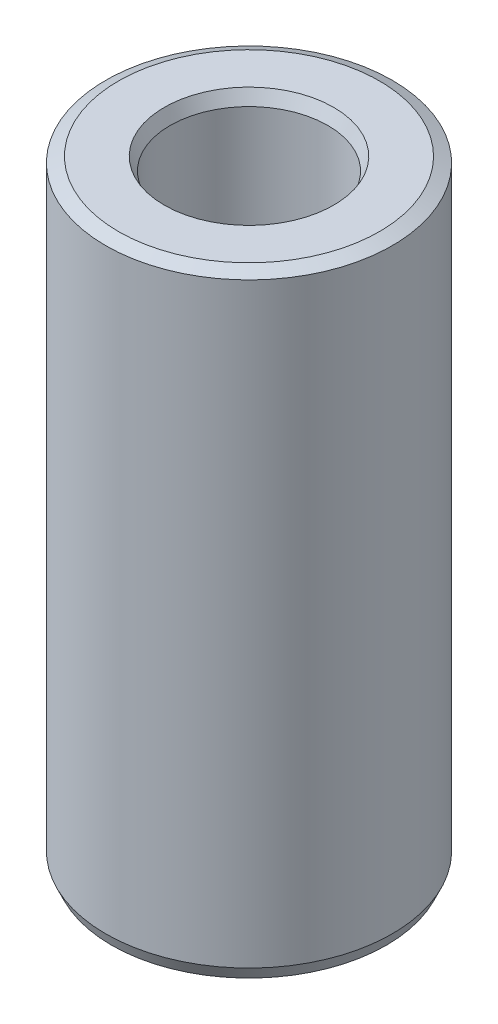
ISO-10303-21;
HEADER;
FILE_DESCRIPTION(('STEP AP214'),'2;1');
FILE_NAME('part.step','',(''),(''),'','','');
FILE_SCHEMA(('AUTOMOTIVE_DESIGN { 1 0 10303 214 1 1 1 1 }'));
ENDSEC;
DATA;
#1=APPLICATION_CONTEXT('core data for automotive mechanical design processes');
#2=APPLICATION_PROTOCOL_DEFINITION('international standard','automotive_design',2000,#1);
#3=PRODUCT_CONTEXT('',#1,'mechanical');
#4=PRODUCT('Part','Part','',(#3));
#5=PRODUCT_RELATED_PRODUCT_CATEGORY('part','',(#4));
#6=PRODUCT_DEFINITION_FORMATION('','',#4);
#7=PRODUCT_DEFINITION_CONTEXT('part definition',#1,'design');
#8=PRODUCT_DEFINITION('design','',#6,#7);
#9=PRODUCT_DEFINITION_SHAPE('','',#8);
#10=(LENGTH_UNIT() NAMED_UNIT(*) SI_UNIT(.MILLI.,.METRE.));
#11=(NAMED_UNIT(*) PLANE_ANGLE_UNIT() SI_UNIT($,.RADIAN.));
#12=(NAMED_UNIT(*) SI_UNIT($,.STERADIAN.) SOLID_ANGLE_UNIT());
#13=UNCERTAINTY_MEASURE_WITH_UNIT(LENGTH_MEASURE(1.E-05),#10,'distance_accuracy_value','');
#14=(GEOMETRIC_REPRESENTATION_CONTEXT(3) GLOBAL_UNCERTAINTY_ASSIGNED_CONTEXT((#13)) GLOBAL_UNIT_ASSIGNED_CONTEXT((#10,
#11,#12)) REPRESENTATION_CONTEXT('',''));
#15=CARTESIAN_POINT('',(0.,0.,0.));
#16=DIRECTION('',(0.,0.,1.));
#17=DIRECTION('',(1.,0.,0.));
#18=AXIS2_PLACEMENT_3D('',#15,#16,#17);
#19=CARTESIAN_POINT('',(0.,139.398685956826,0.));
#20=DIRECTION('',(0.,-1.,0.));
#21=DIRECTION('',(0.,0.,-1.));
#22=AXIS2_PLACEMENT_3D('',#19,#20,#21);
#23=CYLINDRICAL_SURFACE('',#22,32.5);
#24=CARTESIAN_POINT('',(0.,2.89853970592807,0.));
#25=DIRECTION('',(0.,1.,0.));
#26=DIRECTION('',(0.,0.,1.));
#27=AXIS2_PLACEMENT_3D('',#24,#25,#26);
#28=CIRCLE('',#27,32.5);
#29=CARTESIAN_POINT('',(0.,2.89853970592807,32.5));
#30=VERTEX_POINT('',#29);
#31=EDGE_CURVE('E10',#30,#30,#28,.T.);
#32=ORIENTED_EDGE('',*,*,#31,.T.);
#33=EDGE_LOOP('',(#32));
#34=FACE_BOUND('',#33,.T.);
#35=CARTESIAN_POINT('',(0.,138.082120174038,0.));
#36=DIRECTION('',(0.,1.,0.));
#37=DIRECTION('',(0.,0.,1.));
#38=AXIS2_PLACEMENT_3D('',#35,#36,#37);
#39=CIRCLE('',#38,32.5);
#40=CARTESIAN_POINT('',(0.,138.082120174038,32.5));
#41=VERTEX_POINT('',#40);
#42=EDGE_CURVE('E50',#41,#41,#39,.F.);
#43=ORIENTED_EDGE('',*,*,#42,.T.);
#44=EDGE_LOOP('',(#43));
#45=FACE_BOUND('',#44,.T.);
#46=ADVANCED_FACE('F39',(#34,#45),#23,.T.);
#47=CARTESIAN_POINT('',(0.,139.398685956826,0.));
#48=DIRECTION('',(0.,1.,0.));
#49=DIRECTION('',(0.,0.,1.));
#50=AXIS2_PLACEMENT_3D('',#47,#48,#49);
#51=PLANE('',#50);
#52=CARTESIAN_POINT('',(0.,139.398685956826,0.));
#53=DIRECTION('',(0.,1.,0.));
#54=DIRECTION('',(0.,0.,1.));
#55=AXIS2_PLACEMENT_3D('',#52,#53,#54);
#56=CIRCLE('',#55,19.2189035642523);
#57=CARTESIAN_POINT('',(0.,139.398685956826,19.2189035642523));
#58=VERTEX_POINT('',#57);
#59=EDGE_CURVE('E58',#58,#58,#56,.F.);
#60=ORIENTED_EDGE('',*,*,#59,.T.);
#61=EDGE_LOOP('',(#60));
#62=FACE_BOUND('',#61,.T.);
#63=CARTESIAN_POINT('',(0.,139.398685956826,0.));
#64=DIRECTION('',(0.,1.,0.));
#65=DIRECTION('',(0.,0.,1.));
#66=AXIS2_PLACEMENT_3D('',#63,#64,#65);
#67=CIRCLE('',#66,29.6014602940719);
#68=CARTESIAN_POINT('',(0.,139.398685956826,29.6014602940719));
#69=VERTEX_POINT('',#68);
#70=EDGE_CURVE('E61',#69,#69,#67,.T.);
#71=ORIENTED_EDGE('',*,*,#70,.T.);
#72=EDGE_LOOP('',(#71));
#73=FACE_BOUND('',#72,.T.);
#74=ADVANCED_FACE('F88',(#62,#73),#51,.T.);
#75=CARTESIAN_POINT('',(0.,0.,0.));
#76=DIRECTION('',(0.,1.,0.));
#77=DIRECTION('',(0.,0.,1.));
#78=AXIS2_PLACEMENT_3D('',#75,#76,#77);
#79=PLANE('',#78);
#80=CARTESIAN_POINT('',(0.,0.,0.));
#81=DIRECTION('',(0.,1.,0.));
#82=DIRECTION('',(0.,0.,1.));
#83=AXIS2_PLACEMENT_3D('',#80,#81,#82);
#84=CIRCLE('',#83,20.8008774873924);
#85=CARTESIAN_POINT('',(0.,0.,20.8008774873924));
#86=VERTEX_POINT('',#85);
#87=EDGE_CURVE('E51',#86,#86,#84,.T.);
#88=ORIENTED_EDGE('',*,*,#87,.T.);
#89=EDGE_LOOP('',(#88));
#90=FACE_BOUND('',#89,.T.);
#91=CARTESIAN_POINT('',(0.,0.,0.));
#92=DIRECTION('',(0.,1.,0.));
#93=DIRECTION('',(0.,0.,1.));
#94=AXIS2_PLACEMENT_3D('',#91,#92,#93);
#95=CIRCLE('',#94,31.183434217212);
#96=CARTESIAN_POINT('',(0.,0.,31.183434217212));
#97=VERTEX_POINT('',#96);
#98=EDGE_CURVE('E54',#97,#97,#95,.F.);
#99=ORIENTED_EDGE('',*,*,#98,.T.);
#100=EDGE_LOOP('',(#99));
#101=FACE_BOUND('',#100,.T.);
#102=ADVANCED_FACE('F83',(#90,#101),#79,.F.);
#103=CARTESIAN_POINT('',(0.,139.398685956826,0.));
#104=DIRECTION('',(0.,-1.,0.));
#105=DIRECTION('',(0.,0.,-1.));
#106=AXIS2_PLACEMENT_3D('',#103,#104,#105);
#107=CYLINDRICAL_SURFACE('',#106,17.9023377814643);
#108=CARTESIAN_POINT('',(0.,136.500146250898,0.));
#109=DIRECTION('',(0.,1.,0.));
#110=DIRECTION('',(0.,0.,1.));
#111=AXIS2_PLACEMENT_3D('',#108,#109,#110);
#112=CIRCLE('',#111,17.9023377814643);
#113=CARTESIAN_POINT('',(0.,136.500146250898,17.9023377814643));
#114=VERTEX_POINT('',#113);
#115=EDGE_CURVE('E67',#114,#114,#112,.T.);
#116=ORIENTED_EDGE('',*,*,#115,.T.);
#117=EDGE_LOOP('',(#116));
#118=FACE_BOUND('',#117,.T.);
#119=CARTESIAN_POINT('',(0.,1.31656578278802,0.));
#120=DIRECTION('',(0.,1.,0.));
#121=DIRECTION('',(0.,0.,1.));
#122=AXIS2_PLACEMENT_3D('',#119,#120,#121);
#123=CIRCLE('',#122,17.9023377814643);
#124=CARTESIAN_POINT('',(0.,1.31656578278802,17.9023377814643));
#125=VERTEX_POINT('',#124);
#126=EDGE_CURVE('E69',#125,#125,#123,.F.);
#127=ORIENTED_EDGE('',*,*,#126,.T.);
#128=EDGE_LOOP('',(#127));
#129=FACE_BOUND('',#128,.T.);
#130=ADVANCED_FACE('F71',(#118,#129),#107,.F.);
#131=CARTESIAN_POINT('',(0.,136.500146250898,0.));
#132=DIRECTION('',(0.,1.,0.));
#133=DIRECTION('',(0.,0.,1.));
#134=AXIS2_PLACEMENT_3D('',#131,#132,#133);
#135=CONICAL_SURFACE('',#134,17.9023377814643,0.426355182249462);
#136=ORIENTED_EDGE('',*,*,#59,.F.);
#137=EDGE_LOOP('',(#136));
#138=FACE_BOUND('',#137,.T.);
#139=ORIENTED_EDGE('',*,*,#115,.F.);
#140=EDGE_LOOP('',(#139));
#141=FACE_BOUND('',#140,.T.);
#142=ADVANCED_FACE('F77',(#138,#141),#135,.F.);
#143=CARTESIAN_POINT('',(0.,0.,0.));
#144=DIRECTION('',(0.,-1.,0.));
#145=DIRECTION('',(0.,0.,-1.));
#146=AXIS2_PLACEMENT_3D('',#143,#144,#145);
#147=CONICAL_SURFACE('',#146,20.8008774873924,1.14444114454543);
#148=ORIENTED_EDGE('',*,*,#126,.F.);
#149=EDGE_LOOP('',(#148));
#150=FACE_BOUND('',#149,.T.);
#151=ORIENTED_EDGE('',*,*,#87,.F.);
#152=EDGE_LOOP('',(#151));
#153=FACE_BOUND('',#152,.T.);
#154=ADVANCED_FACE('F73',(#150,#153),#147,.F.);
#155=CARTESIAN_POINT('',(0.,2.89853970592807,0.));
#156=DIRECTION('',(0.,1.,0.));
#157=DIRECTION('',(0.,0.,1.));
#158=AXIS2_PLACEMENT_3D('',#155,#156,#157);
#159=CONICAL_SURFACE('',#158,32.5,0.426355182249466);
#160=ORIENTED_EDGE('',*,*,#98,.F.);
#161=EDGE_LOOP('',(#160));
#162=FACE_BOUND('',#161,.T.);
#163=ORIENTED_EDGE('',*,*,#31,.F.);
#164=EDGE_LOOP('',(#163));
#165=FACE_BOUND('',#164,.T.);
#166=ADVANCED_FACE('F76',(#162,#165),#159,.T.);
#167=CARTESIAN_POINT('',(0.,139.398685956826,0.));
#168=DIRECTION('',(0.,-1.,0.));
#169=DIRECTION('',(0.,0.,-1.));
#170=AXIS2_PLACEMENT_3D('',#167,#168,#169);
#171=CONICAL_SURFACE('',#170,29.6014602940719,1.14444114454543);
#172=ORIENTED_EDGE('',*,*,#42,.F.);
#173=EDGE_LOOP('',(#172));
#174=FACE_BOUND('',#173,.T.);
#175=ORIENTED_EDGE('',*,*,#70,.F.);
#176=EDGE_LOOP('',(#175));
#177=FACE_BOUND('',#176,.T.);
#178=ADVANCED_FACE('F45',(#174,#177),#171,.T.);
#179=CLOSED_SHELL('',(#46,#74,#102,#130,#142,#154,#166,#178));
#180=MANIFOLD_SOLID_BREP('B2',#179);
#181=ADVANCED_BREP_SHAPE_REPRESENTATION('',(#18,#180),#14);
#182=SHAPE_DEFINITION_REPRESENTATION(#9,#181);
ENDSEC;
END-ISO-10303-21;
